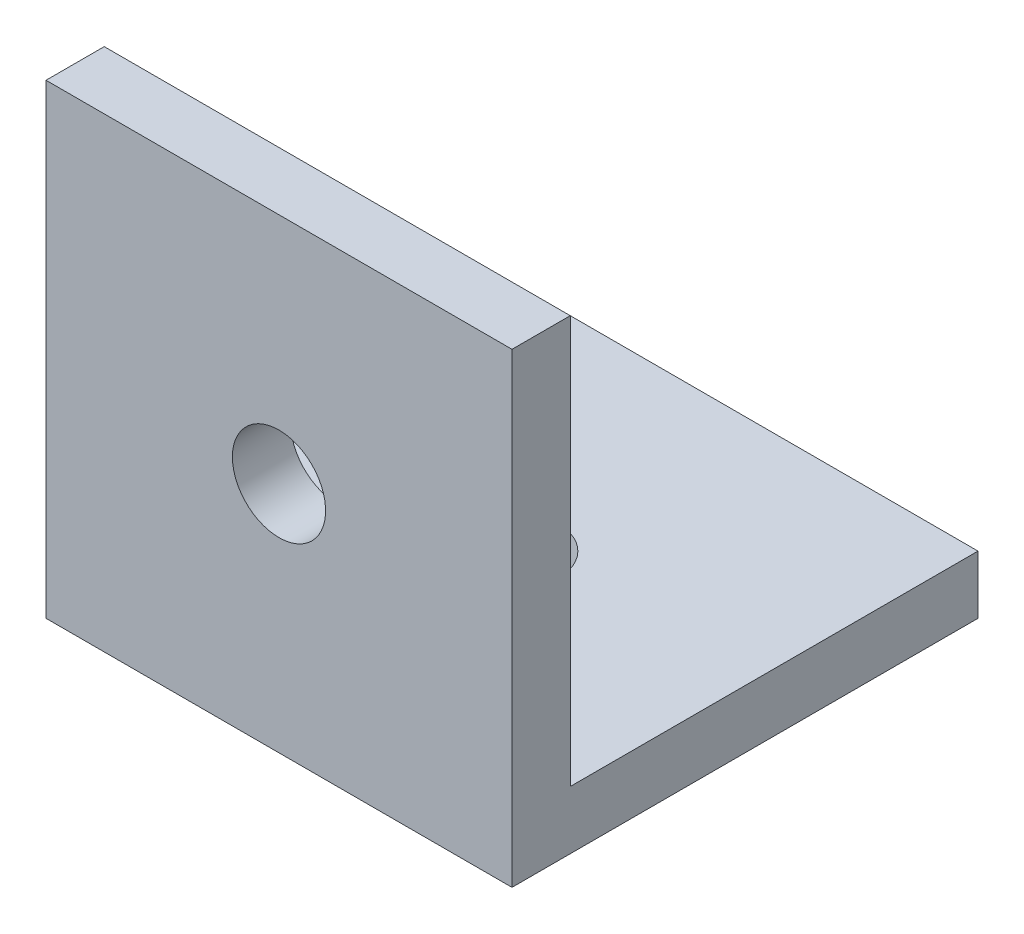
ISO-10303-21;
HEADER;
FILE_DESCRIPTION(('STEP AP214'),'2;1');
FILE_NAME('part.step','',(''),(''),'','','');
FILE_SCHEMA(('AUTOMOTIVE_DESIGN { 1 0 10303 214 1 1 1 1 }'));
ENDSEC;
DATA;
#1=APPLICATION_CONTEXT('core data for automotive mechanical design processes');
#2=APPLICATION_PROTOCOL_DEFINITION('international standard','automotive_design',2000,#1);
#3=PRODUCT_CONTEXT('',#1,'mechanical');
#4=PRODUCT('Part','Part','',(#3));
#5=PRODUCT_RELATED_PRODUCT_CATEGORY('part','',(#4));
#6=PRODUCT_DEFINITION_FORMATION('','',#4);
#7=PRODUCT_DEFINITION_CONTEXT('part definition',#1,'design');
#8=PRODUCT_DEFINITION('design','',#6,#7);
#9=PRODUCT_DEFINITION_SHAPE('','',#8);
#10=(LENGTH_UNIT() NAMED_UNIT(*) SI_UNIT(.MILLI.,.METRE.));
#11=(NAMED_UNIT(*) PLANE_ANGLE_UNIT() SI_UNIT($,.RADIAN.));
#12=(NAMED_UNIT(*) SI_UNIT($,.STERADIAN.) SOLID_ANGLE_UNIT());
#13=UNCERTAINTY_MEASURE_WITH_UNIT(LENGTH_MEASURE(1.E-05),#10,'distance_accuracy_value','');
#14=(GEOMETRIC_REPRESENTATION_CONTEXT(3) GLOBAL_UNCERTAINTY_ASSIGNED_CONTEXT((#13)) GLOBAL_UNIT_ASSIGNED_CONTEXT((#10,
#11,#12)) REPRESENTATION_CONTEXT('',''));
#15=CARTESIAN_POINT('',(0.,0.,0.));
#16=DIRECTION('',(0.,0.,1.));
#17=DIRECTION('',(1.,0.,0.));
#18=AXIS2_PLACEMENT_3D('',#15,#16,#17);
#19=CARTESIAN_POINT('',(0.,0.,0.));
#20=DIRECTION('',(0.,0.,1.));
#21=DIRECTION('',(1.,0.,0.));
#22=AXIS2_PLACEMENT_3D('',#19,#20,#21);
#23=PLANE('',#22);
#24=CARTESIAN_POINT('',(0.,0.,0.));
#25=DIRECTION('',(0.,0.,-1.));
#26=DIRECTION('',(-1.,0.,0.));
#27=AXIS2_PLACEMENT_3D('',#24,#25,#26);
#28=CIRCLE('',#27,2.54);
#29=CARTESIAN_POINT('',(-2.54,0.,0.));
#30=VERTEX_POINT('',#29);
#31=EDGE_CURVE('E150',#30,#30,#28,.T.);
#32=ORIENTED_EDGE('',*,*,#31,.F.);
#33=EDGE_LOOP('',(#32));
#34=FACE_BOUND('',#33,.T.);
#35=DIRECTION('',(1.,0.,0.));
#36=VECTOR('',#35,1.);
#37=CARTESIAN_POINT('',(-12.7,-9.525,0.));
#38=LINE('',#37,#36);
#39=CARTESIAN_POINT('',(-12.7,-9.525,0.));
#40=VERTEX_POINT('',#39);
#41=CARTESIAN_POINT('',(12.7,-9.525,0.));
#42=VERTEX_POINT('',#41);
#43=EDGE_CURVE('E47',#40,#42,#38,.T.);
#44=ORIENTED_EDGE('',*,*,#43,.F.);
#45=DIRECTION('',(0.,-1.,0.));
#46=VECTOR('',#45,1.);
#47=CARTESIAN_POINT('',(-12.7,-12.7,0.));
#48=LINE('',#47,#46);
#49=CARTESIAN_POINT('',(-12.7,12.7,0.));
#50=VERTEX_POINT('',#49);
#51=EDGE_CURVE('E115',#50,#40,#48,.T.);
#52=ORIENTED_EDGE('',*,*,#51,.F.);
#53=DIRECTION('',(-1.,0.,0.));
#54=VECTOR('',#53,1.);
#55=CARTESIAN_POINT('',(12.7,12.7,0.));
#56=LINE('',#55,#54);
#57=CARTESIAN_POINT('',(12.7,12.7,0.));
#58=VERTEX_POINT('',#57);
#59=EDGE_CURVE('E71',#58,#50,#56,.T.);
#60=ORIENTED_EDGE('',*,*,#59,.F.);
#61=DIRECTION('',(0.,1.,0.));
#62=VECTOR('',#61,1.);
#63=CARTESIAN_POINT('',(12.7,-12.7,0.));
#64=LINE('',#63,#62);
#65=EDGE_CURVE('E117',#42,#58,#64,.T.);
#66=ORIENTED_EDGE('',*,*,#65,.F.);
#67=EDGE_LOOP('',(#44,#52,#60,#66));
#68=FACE_BOUND('',#67,.T.);
#69=ADVANCED_FACE('F32',(#34,#68),#23,.F.);
#70=CARTESIAN_POINT('',(-12.7,-12.7,3.175));
#71=DIRECTION('',(1.,0.,0.));
#72=DIRECTION('',(0.,0.,-1.));
#73=AXIS2_PLACEMENT_3D('',#70,#71,#72);
#74=PLANE('',#73);
#75=ORIENTED_EDGE('',*,*,#51,.T.);
#76=DIRECTION('',(0.,0.,1.));
#77=VECTOR('',#76,1.);
#78=CARTESIAN_POINT('',(-12.7,-9.525,-22.225));
#79=LINE('',#78,#77);
#80=CARTESIAN_POINT('',(-12.7,-9.525,-22.225));
#81=VERTEX_POINT('',#80);
#82=EDGE_CURVE('E98',#81,#40,#79,.T.);
#83=ORIENTED_EDGE('',*,*,#82,.F.);
#84=DIRECTION('',(0.,1.,0.));
#85=VECTOR('',#84,1.);
#86=CARTESIAN_POINT('',(-12.7,-9.525,-22.225));
#87=LINE('',#86,#85);
#88=CARTESIAN_POINT('',(-12.7,-12.7,-22.225));
#89=VERTEX_POINT('',#88);
#90=EDGE_CURVE('E105',#89,#81,#87,.T.);
#91=ORIENTED_EDGE('',*,*,#90,.F.);
#92=DIRECTION('',(0.,0.,-1.));
#93=VECTOR('',#92,1.);
#94=CARTESIAN_POINT('',(-12.7,-12.7,3.175));
#95=LINE('',#94,#93);
#96=CARTESIAN_POINT('',(-12.7,-12.7,3.175));
#97=VERTEX_POINT('',#96);
#98=EDGE_CURVE('E11',#97,#89,#95,.T.);
#99=ORIENTED_EDGE('',*,*,#98,.F.);
#100=DIRECTION('',(0.,-1.,0.));
#101=VECTOR('',#100,1.);
#102=CARTESIAN_POINT('',(-12.7,-12.7,3.175));
#103=LINE('',#102,#101);
#104=CARTESIAN_POINT('',(-12.7,12.7,3.175));
#105=VERTEX_POINT('',#104);
#106=EDGE_CURVE('E122',#105,#97,#103,.T.);
#107=ORIENTED_EDGE('',*,*,#106,.F.);
#108=DIRECTION('',(0.,0.,-1.));
#109=VECTOR('',#108,1.);
#110=CARTESIAN_POINT('',(-12.7,12.7,3.175));
#111=LINE('',#110,#109);
#112=EDGE_CURVE('E127',#105,#50,#111,.T.);
#113=ORIENTED_EDGE('',*,*,#112,.T.);
#114=EDGE_LOOP('',(#75,#83,#91,#99,#107,#113));
#115=FACE_BOUND('',#114,.T.);
#116=ADVANCED_FACE('F34',(#115),#74,.F.);
#117=CARTESIAN_POINT('',(12.7,-12.7,3.175));
#118=DIRECTION('',(0.,1.,0.));
#119=DIRECTION('',(0.,0.,1.));
#120=AXIS2_PLACEMENT_3D('',#117,#118,#119);
#121=PLANE('',#120);
#122=CARTESIAN_POINT('',(0.,-12.7,-9.525));
#123=DIRECTION('',(0.,1.,0.));
#124=DIRECTION('',(0.,0.,1.));
#125=AXIS2_PLACEMENT_3D('',#122,#123,#124);
#126=CIRCLE('',#125,2.54);
#127=CARTESIAN_POINT('',(0.,-12.7,-6.985));
#128=VERTEX_POINT('',#127);
#129=EDGE_CURVE('E140',#128,#128,#126,.T.);
#130=ORIENTED_EDGE('',*,*,#129,.T.);
#131=EDGE_LOOP('',(#130));
#132=FACE_BOUND('',#131,.T.);
#133=ORIENTED_EDGE('',*,*,#98,.T.);
#134=DIRECTION('',(-1.,0.,0.));
#135=VECTOR('',#134,1.);
#136=CARTESIAN_POINT('',(-12.7,-12.7,-22.225));
#137=LINE('',#136,#135);
#138=CARTESIAN_POINT('',(12.7,-12.7,-22.225));
#139=VERTEX_POINT('',#138);
#140=EDGE_CURVE('E111',#139,#89,#137,.T.);
#141=ORIENTED_EDGE('',*,*,#140,.F.);
#142=DIRECTION('',(0.,0.,-1.));
#143=VECTOR('',#142,1.);
#144=CARTESIAN_POINT('',(12.7,-12.7,3.175));
#145=LINE('',#144,#143);
#146=CARTESIAN_POINT('',(12.7,-12.7,3.175));
#147=VERTEX_POINT('',#146);
#148=EDGE_CURVE('E40',#147,#139,#145,.T.);
#149=ORIENTED_EDGE('',*,*,#148,.F.);
#150=DIRECTION('',(1.,0.,0.));
#151=VECTOR('',#150,1.);
#152=CARTESIAN_POINT('',(12.7,-12.7,3.175));
#153=LINE('',#152,#151);
#154=EDGE_CURVE('E78',#97,#147,#153,.T.);
#155=ORIENTED_EDGE('',*,*,#154,.F.);
#156=EDGE_LOOP('',(#133,#141,#149,#155));
#157=FACE_BOUND('',#156,.T.);
#158=ADVANCED_FACE('F138',(#132,#157),#121,.F.);
#159=CARTESIAN_POINT('',(12.7,-12.7,3.175));
#160=DIRECTION('',(-1.,0.,0.));
#161=DIRECTION('',(0.,0.,1.));
#162=AXIS2_PLACEMENT_3D('',#159,#160,#161);
#163=PLANE('',#162);
#164=ORIENTED_EDGE('',*,*,#148,.T.);
#165=DIRECTION('',(0.,-1.,0.));
#166=VECTOR('',#165,1.);
#167=CARTESIAN_POINT('',(12.7,-9.525,-22.225));
#168=LINE('',#167,#166);
#169=CARTESIAN_POINT('',(12.7,-9.525,-22.225));
#170=VERTEX_POINT('',#169);
#171=EDGE_CURVE('E104',#170,#139,#168,.T.);
#172=ORIENTED_EDGE('',*,*,#171,.F.);
#173=DIRECTION('',(0.,0.,1.));
#174=VECTOR('',#173,1.);
#175=CARTESIAN_POINT('',(12.7,-9.525,-22.225));
#176=LINE('',#175,#174);
#177=EDGE_CURVE('E100',#170,#42,#176,.T.);
#178=ORIENTED_EDGE('',*,*,#177,.T.);
#179=ORIENTED_EDGE('',*,*,#65,.T.);
#180=DIRECTION('',(0.,0.,-1.));
#181=VECTOR('',#180,1.);
#182=CARTESIAN_POINT('',(12.7,12.7,3.175));
#183=LINE('',#182,#181);
#184=CARTESIAN_POINT('',(12.7,12.7,3.175));
#185=VERTEX_POINT('',#184);
#186=EDGE_CURVE('E132',#185,#58,#183,.T.);
#187=ORIENTED_EDGE('',*,*,#186,.F.);
#188=DIRECTION('',(0.,1.,0.));
#189=VECTOR('',#188,1.);
#190=CARTESIAN_POINT('',(12.7,-12.7,3.175));
#191=LINE('',#190,#189);
#192=EDGE_CURVE('E125',#147,#185,#191,.T.);
#193=ORIENTED_EDGE('',*,*,#192,.F.);
#194=EDGE_LOOP('',(#164,#172,#178,#179,#187,#193));
#195=FACE_BOUND('',#194,.T.);
#196=ADVANCED_FACE('F135',(#195),#163,.F.);
#197=CARTESIAN_POINT('',(12.7,12.7,3.175));
#198=DIRECTION('',(0.,-1.,0.));
#199=DIRECTION('',(1.,0.,0.));
#200=AXIS2_PLACEMENT_3D('',#197,#198,#199);
#201=PLANE('',#200);
#202=ORIENTED_EDGE('',*,*,#59,.T.);
#203=ORIENTED_EDGE('',*,*,#112,.F.);
#204=DIRECTION('',(-1.,0.,0.));
#205=VECTOR('',#204,1.);
#206=CARTESIAN_POINT('',(12.7,12.7,3.175));
#207=LINE('',#206,#205);
#208=EDGE_CURVE('E56',#185,#105,#207,.T.);
#209=ORIENTED_EDGE('',*,*,#208,.F.);
#210=ORIENTED_EDGE('',*,*,#186,.T.);
#211=EDGE_LOOP('',(#202,#203,#209,#210));
#212=FACE_BOUND('',#211,.T.);
#213=ADVANCED_FACE('F173',(#212),#201,.F.);
#214=CARTESIAN_POINT('',(0.,0.,3.175));
#215=DIRECTION('',(0.,0.,1.));
#216=DIRECTION('',(1.,0.,0.));
#217=AXIS2_PLACEMENT_3D('',#214,#215,#216);
#218=PLANE('',#217);
#219=CARTESIAN_POINT('',(0.,0.,3.175));
#220=DIRECTION('',(0.,0.,-1.));
#221=DIRECTION('',(-1.,0.,0.));
#222=AXIS2_PLACEMENT_3D('',#219,#220,#221);
#223=CIRCLE('',#222,2.54);
#224=CARTESIAN_POINT('',(-2.54,0.,3.175));
#225=VERTEX_POINT('',#224);
#226=EDGE_CURVE('E147',#225,#225,#223,.T.);
#227=ORIENTED_EDGE('',*,*,#226,.T.);
#228=EDGE_LOOP('',(#227));
#229=FACE_BOUND('',#228,.T.);
#230=ORIENTED_EDGE('',*,*,#106,.T.);
#231=ORIENTED_EDGE('',*,*,#154,.T.);
#232=ORIENTED_EDGE('',*,*,#192,.T.);
#233=ORIENTED_EDGE('',*,*,#208,.T.);
#234=EDGE_LOOP('',(#230,#231,#232,#233));
#235=FACE_BOUND('',#234,.T.);
#236=ADVANCED_FACE('F156',(#229,#235),#218,.T.);
#237=CARTESIAN_POINT('',(-12.7,-9.525,-22.225));
#238=DIRECTION('',(0.,-1.,0.));
#239=DIRECTION('',(0.,0.,-1.));
#240=AXIS2_PLACEMENT_3D('',#237,#238,#239);
#241=PLANE('',#240);
#242=CARTESIAN_POINT('',(0.,-9.525,-9.525));
#243=DIRECTION('',(0.,1.,0.));
#244=DIRECTION('',(0.,0.,1.));
#245=AXIS2_PLACEMENT_3D('',#242,#243,#244);
#246=CIRCLE('',#245,2.54);
#247=CARTESIAN_POINT('',(0.,-9.525,-6.985));
#248=VERTEX_POINT('',#247);
#249=EDGE_CURVE('E142',#248,#248,#246,.T.);
#250=ORIENTED_EDGE('',*,*,#249,.F.);
#251=EDGE_LOOP('',(#250));
#252=FACE_BOUND('',#251,.T.);
#253=ORIENTED_EDGE('',*,*,#43,.T.);
#254=ORIENTED_EDGE('',*,*,#177,.F.);
#255=DIRECTION('',(1.,0.,0.));
#256=VECTOR('',#255,1.);
#257=CARTESIAN_POINT('',(-12.7,-9.525,-22.225));
#258=LINE('',#257,#256);
#259=EDGE_CURVE('E94',#81,#170,#258,.T.);
#260=ORIENTED_EDGE('',*,*,#259,.F.);
#261=ORIENTED_EDGE('',*,*,#82,.T.);
#262=EDGE_LOOP('',(#253,#254,#260,#261));
#263=FACE_BOUND('',#262,.T.);
#264=ADVANCED_FACE('F96',(#252,#263),#241,.F.);
#265=CARTESIAN_POINT('',(0.,0.,-22.225));
#266=DIRECTION('',(0.,0.,1.));
#267=DIRECTION('',(1.,0.,0.));
#268=AXIS2_PLACEMENT_3D('',#265,#266,#267);
#269=PLANE('',#268);
#270=ORIENTED_EDGE('',*,*,#90,.T.);
#271=ORIENTED_EDGE('',*,*,#259,.T.);
#272=ORIENTED_EDGE('',*,*,#171,.T.);
#273=ORIENTED_EDGE('',*,*,#140,.T.);
#274=EDGE_LOOP('',(#270,#271,#272,#273));
#275=FACE_BOUND('',#274,.T.);
#276=ADVANCED_FACE('F109',(#275),#269,.F.);
#277=CARTESIAN_POINT('',(0.,-12.7,-9.525));
#278=DIRECTION('',(0.,1.,0.));
#279=DIRECTION('',(0.,0.,1.));
#280=AXIS2_PLACEMENT_3D('',#277,#278,#279);
#281=CYLINDRICAL_SURFACE('',#280,2.54);
#282=ORIENTED_EDGE('',*,*,#129,.F.);
#283=EDGE_LOOP('',(#282));
#284=FACE_BOUND('',#283,.T.);
#285=ORIENTED_EDGE('',*,*,#249,.T.);
#286=EDGE_LOOP('',(#285));
#287=FACE_BOUND('',#286,.T.);
#288=ADVANCED_FACE('F161',(#284,#287),#281,.F.);
#289=CARTESIAN_POINT('',(0.,0.,3.175));
#290=DIRECTION('',(0.,0.,-1.));
#291=DIRECTION('',(-1.,0.,0.));
#292=AXIS2_PLACEMENT_3D('',#289,#290,#291);
#293=CYLINDRICAL_SURFACE('',#292,2.54);
#294=ORIENTED_EDGE('',*,*,#226,.F.);
#295=EDGE_LOOP('',(#294));
#296=FACE_BOUND('',#295,.T.);
#297=ORIENTED_EDGE('',*,*,#31,.T.);
#298=EDGE_LOOP('',(#297));
#299=FACE_BOUND('',#298,.T.);
#300=ADVANCED_FACE('F158',(#296,#299),#293,.F.);
#301=CLOSED_SHELL('',(#69,#116,#158,#196,#213,#236,#264,#276,#288,#300));
#302=MANIFOLD_SOLID_BREP('B2',#301);
#303=ADVANCED_BREP_SHAPE_REPRESENTATION('',(#18,#302),#14);
#304=SHAPE_DEFINITION_REPRESENTATION(#9,#303);
ENDSEC;
END-ISO-10303-21;
